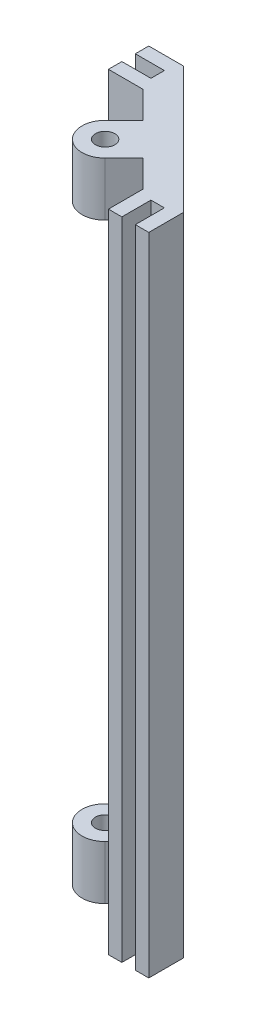
ISO-10303-21;
HEADER;
FILE_DESCRIPTION(('STEP AP214'),'2;1');
FILE_NAME('part.step','',(''),(''),'','','');
FILE_SCHEMA(('AUTOMOTIVE_DESIGN { 1 0 10303 214 1 1 1 1 }'));
ENDSEC;
DATA;
#1=APPLICATION_CONTEXT('core data for automotive mechanical design processes');
#2=APPLICATION_PROTOCOL_DEFINITION('international standard','automotive_design',2000,#1);
#3=PRODUCT_CONTEXT('',#1,'mechanical');
#4=PRODUCT('Part','Part','',(#3));
#5=PRODUCT_RELATED_PRODUCT_CATEGORY('part','',(#4));
#6=PRODUCT_DEFINITION_FORMATION('','',#4);
#7=PRODUCT_DEFINITION_CONTEXT('part definition',#1,'design');
#8=PRODUCT_DEFINITION('design','',#6,#7);
#9=PRODUCT_DEFINITION_SHAPE('','',#8);
#10=(LENGTH_UNIT() NAMED_UNIT(*) SI_UNIT(.MILLI.,.METRE.));
#11=(NAMED_UNIT(*) PLANE_ANGLE_UNIT() SI_UNIT($,.RADIAN.));
#12=(NAMED_UNIT(*) SI_UNIT($,.STERADIAN.) SOLID_ANGLE_UNIT());
#13=UNCERTAINTY_MEASURE_WITH_UNIT(LENGTH_MEASURE(1.E-05),#10,'distance_accuracy_value','');
#14=(GEOMETRIC_REPRESENTATION_CONTEXT(3) GLOBAL_UNCERTAINTY_ASSIGNED_CONTEXT((#13)) GLOBAL_UNIT_ASSIGNED_CONTEXT((#10,
#11,#12)) REPRESENTATION_CONTEXT('',''));
#15=CARTESIAN_POINT('',(0.,0.,0.));
#16=DIRECTION('',(0.,0.,1.));
#17=DIRECTION('',(1.,0.,0.));
#18=AXIS2_PLACEMENT_3D('',#15,#16,#17);
#19=CARTESIAN_POINT('',(22.2539461017924,152.4,-14.530925837673));
#20=DIRECTION('',(0.707106781186547,0.,-0.707106781186548));
#21=DIRECTION('',(-0.707106781186548,0.,-0.707106781186547));
#22=AXIS2_PLACEMENT_3D('',#19,#20,#21);
#23=PLANE('',#22);
#24=DIRECTION('',(0.,-1.,0.));
#25=VECTOR('',#24,1.);
#26=CARTESIAN_POINT('',(16.1473719394654,139.7,-20.6375));
#27=LINE('',#26,#25);
#28=CARTESIAN_POINT('',(16.1473719394654,139.7,-20.6375));
#29=VERTEX_POINT('',#28);
#30=CARTESIAN_POINT('',(16.1473719394654,12.7,-20.6375));
#31=VERTEX_POINT('',#30);
#32=EDGE_CURVE('E256',#29,#31,#27,.T.);
#33=ORIENTED_EDGE('',*,*,#32,.F.);
#34=DIRECTION('',(-0.707106781186554,0.,-0.707106781186541));
#35=VECTOR('',#34,1.);
#36=CARTESIAN_POINT('',(22.2539461017927,139.7,-14.5309258376728));
#37=LINE('',#36,#35);
#38=CARTESIAN_POINT('',(14.5309258376731,139.7,-22.2539461017922));
#39=VERTEX_POINT('',#38);
#40=EDGE_CURVE('E269',#29,#39,#37,.T.);
#41=ORIENTED_EDGE('',*,*,#40,.T.);
#42=DIRECTION('',(0.,-1.,0.));
#43=VECTOR('',#42,1.);
#44=CARTESIAN_POINT('',(14.530925837673,152.4,-22.2539461017924));
#45=LINE('',#44,#43);
#46=CARTESIAN_POINT('',(14.530925837673,152.4,-22.2539461017924));
#47=VERTEX_POINT('',#46);
#48=EDGE_CURVE('E474',#47,#39,#45,.T.);
#49=ORIENTED_EDGE('',*,*,#48,.F.);
#50=DIRECTION('',(0.707106781186547,0.,0.707106781186548));
#51=VECTOR('',#50,1.);
#52=CARTESIAN_POINT('',(8.20987193946542,152.4,-28.575));
#53=LINE('',#52,#51);
#54=CARTESIAN_POINT('',(8.20987193946542,152.4,-28.575));
#55=VERTEX_POINT('',#54);
#56=EDGE_CURVE('E341',#55,#47,#53,.T.);
#57=ORIENTED_EDGE('',*,*,#56,.F.);
#58=DIRECTION('',(0.,-1.,0.));
#59=VECTOR('',#58,1.);
#60=CARTESIAN_POINT('',(8.20987193946542,152.4,-28.575));
#61=LINE('',#60,#59);
#62=CARTESIAN_POINT('',(8.20987193946542,0.,-28.575));
#63=VERTEX_POINT('',#62);
#64=EDGE_CURVE('E478',#55,#63,#61,.T.);
#65=ORIENTED_EDGE('',*,*,#64,.T.);
#66=DIRECTION('',(0.707106781186547,0.,0.707106781186548));
#67=VECTOR('',#66,1.);
#68=CARTESIAN_POINT('',(8.20987193946542,0.,-28.575));
#69=LINE('',#68,#67);
#70=CARTESIAN_POINT('',(14.530925837673,0.,-22.2539461017924));
#71=VERTEX_POINT('',#70);
#72=EDGE_CURVE('E402',#63,#71,#69,.T.);
#73=ORIENTED_EDGE('',*,*,#72,.T.);
#74=CARTESIAN_POINT('',(14.5309258376731,12.7,-22.2539461017922));
#75=VERTEX_POINT('',#74);
#76=EDGE_CURVE('E473',#75,#71,#45,.T.);
#77=ORIENTED_EDGE('',*,*,#76,.F.);
#78=DIRECTION('',(0.707106781186554,0.,0.707106781186541));
#79=VECTOR('',#78,1.);
#80=CARTESIAN_POINT('',(22.2539461017927,12.7,-14.5309258376728));
#81=LINE('',#80,#79);
#82=EDGE_CURVE('E274',#75,#31,#81,.T.);
#83=ORIENTED_EDGE('',*,*,#82,.T.);
#84=EDGE_LOOP('',(#33,#41,#49,#57,#65,#73,#77,#83));
#85=FACE_BOUND('',#84,.T.);
#86=ADVANCED_FACE('F39',(#85),#23,.F.);
#87=DIRECTION('',(0.,1.,0.));
#88=VECTOR('',#87,1.);
#89=CARTESIAN_POINT('',(20.6375,139.7,-16.1473719394654));
#90=LINE('',#89,#88);
#91=CARTESIAN_POINT('',(20.6375,12.7,-16.1473719394654));
#92=VERTEX_POINT('',#91);
#93=CARTESIAN_POINT('',(20.6375,139.7,-16.1473719394654));
#94=VERTEX_POINT('',#93);
#95=EDGE_CURVE('E260',#92,#94,#90,.T.);
#96=ORIENTED_EDGE('',*,*,#95,.F.);
#97=CARTESIAN_POINT('',(22.2539461017924,12.7,-14.530925837673));
#98=VERTEX_POINT('',#97);
#99=EDGE_CURVE('E232',#92,#98,#81,.T.);
#100=ORIENTED_EDGE('',*,*,#99,.T.);
#101=DIRECTION('',(0.,-1.,0.));
#102=VECTOR('',#101,1.);
#103=CARTESIAN_POINT('',(22.2539461017924,152.4,-14.530925837673));
#104=LINE('',#103,#102);
#105=CARTESIAN_POINT('',(22.2539461017924,0.,-14.530925837673));
#106=VERTEX_POINT('',#105);
#107=EDGE_CURVE('E458',#98,#106,#104,.T.);
#108=ORIENTED_EDGE('',*,*,#107,.T.);
#109=DIRECTION('',(0.707106781186548,0.,0.707106781186547));
#110=VECTOR('',#109,1.);
#111=CARTESIAN_POINT('',(22.2539461017924,0.,-14.530925837673));
#112=LINE('',#111,#110);
#113=CARTESIAN_POINT('',(28.575,0.,-8.20987193946542));
#114=VERTEX_POINT('',#113);
#115=EDGE_CURVE('E418',#106,#114,#112,.T.);
#116=ORIENTED_EDGE('',*,*,#115,.T.);
#117=DIRECTION('',(0.,-1.,0.));
#118=VECTOR('',#117,1.);
#119=CARTESIAN_POINT('',(28.575,152.4,-8.20987193946542));
#120=LINE('',#119,#118);
#121=CARTESIAN_POINT('',(28.575,152.4,-8.20987193946542));
#122=VERTEX_POINT('',#121);
#123=EDGE_CURVE('E454',#122,#114,#120,.T.);
#124=ORIENTED_EDGE('',*,*,#123,.F.);
#125=DIRECTION('',(0.707106781186548,0.,0.707106781186547));
#126=VECTOR('',#125,1.);
#127=CARTESIAN_POINT('',(22.2539461017924,152.4,-14.530925837673));
#128=LINE('',#127,#126);
#129=CARTESIAN_POINT('',(22.2539461017924,152.4,-14.530925837673));
#130=VERTEX_POINT('',#129);
#131=EDGE_CURVE('E353',#130,#122,#128,.T.);
#132=ORIENTED_EDGE('',*,*,#131,.F.);
#133=CARTESIAN_POINT('',(22.2539461017927,139.7,-14.5309258376728));
#134=VERTEX_POINT('',#133);
#135=EDGE_CURVE('E459',#130,#134,#104,.T.);
#136=ORIENTED_EDGE('',*,*,#135,.T.);
#137=EDGE_CURVE('E270',#134,#94,#37,.T.);
#138=ORIENTED_EDGE('',*,*,#137,.T.);
#139=EDGE_LOOP('',(#96,#100,#108,#116,#124,#132,#136,#138));
#140=FACE_BOUND('',#139,.T.);
#141=ADVANCED_FACE('F530',(#140),#23,.F.);
#142=CARTESIAN_POINT('',(13.9023079091984,139.7,-6.17928764507842));
#143=DIRECTION('',(0.,-1.,0.));
#144=DIRECTION('',(0.,0.,-1.));
#145=AXIS2_PLACEMENT_3D('',#142,#143,#144);
#146=PLANE('',#145);
#147=CARTESIAN_POINT('',(13.9023079091981,139.7,-13.9023079091981));
#148=DIRECTION('',(0.,-1.,0.));
#149=DIRECTION('',(0.,0.,-1.));
#150=AXIS2_PLACEMENT_3D('',#147,#148,#149);
#151=CIRCLE('',#150,2.286);
#152=CARTESIAN_POINT('',(13.9023079091981,139.7,-16.1883079091981));
#153=VERTEX_POINT('',#152);
#154=EDGE_CURVE('E43',#153,#153,#151,.T.);
#155=ORIENTED_EDGE('',*,*,#154,.F.);
#156=EDGE_LOOP('',(#155));
#157=FACE_BOUND('',#156,.T.);
#158=ORIENTED_EDGE('',*,*,#40,.F.);
#159=DIRECTION('',(0.707106781186547,0.,-0.707106781186548));
#160=VECTOR('',#159,1.);
#161=CARTESIAN_POINT('',(15.2493463273585,139.7,-19.7394743878931));
#162=LINE('',#161,#160);
#163=CARTESIAN_POINT('',(15.2493463273585,139.7,-19.7394743878931));
#164=VERTEX_POINT('',#163);
#165=EDGE_CURVE('E57',#164,#29,#162,.T.);
#166=ORIENTED_EDGE('',*,*,#165,.F.);
#167=DIRECTION('',(-0.707106781186548,0.,-0.707106781186547));
#168=VECTOR('',#167,1.);
#169=CARTESIAN_POINT('',(15.2493463273585,139.7,-19.7394743878931));
#170=LINE('',#169,#168);
#171=CARTESIAN_POINT('',(19.7394743878931,139.7,-15.2493463273585));
#172=VERTEX_POINT('',#171);
#173=EDGE_CURVE('E61',#172,#164,#170,.T.);
#174=ORIENTED_EDGE('',*,*,#173,.F.);
#175=DIRECTION('',(0.707106781186547,0.,-0.707106781186548));
#176=VECTOR('',#175,1.);
#177=CARTESIAN_POINT('',(19.7394743878931,139.7,-15.2493463273585));
#178=LINE('',#177,#176);
#179=EDGE_CURVE('E238',#172,#94,#178,.T.);
#180=ORIENTED_EDGE('',*,*,#179,.T.);
#181=ORIENTED_EDGE('',*,*,#137,.F.);
#182=DIRECTION('',(0.707106781186541,0.,-0.707106781186554));
#183=VECTOR('',#182,1.);
#184=CARTESIAN_POINT('',(13.9023079091984,139.7,-6.17928764507842));
#185=LINE('',#184,#183);
#186=CARTESIAN_POINT('',(17.7638180412581,139.7,-10.0407977771382));
#187=VERTEX_POINT('',#186);
#188=EDGE_CURVE('E289',#187,#134,#185,.T.);
#189=ORIENTED_EDGE('',*,*,#188,.F.);
#190=CARTESIAN_POINT('',(13.9023079091981,139.7,-13.9023079091981));
#191=DIRECTION('',(0.,-1.,0.));
#192=DIRECTION('',(0.,0.,-1.));
#193=AXIS2_PLACEMENT_3D('',#190,#191,#192);
#194=CIRCLE('',#193,5.461);
#195=CARTESIAN_POINT('',(10.0407977771386,139.7,-17.7638180412576));
#196=VERTEX_POINT('',#195);
#197=EDGE_CURVE('E297',#187,#196,#194,.T.);
#198=ORIENTED_EDGE('',*,*,#197,.T.);
#199=DIRECTION('',(0.707106781186541,0.,-0.707106781186554));
#200=VECTOR('',#199,1.);
#201=CARTESIAN_POINT('',(6.17928764507891,139.7,-13.9023079091978));
#202=LINE('',#201,#200);
#203=EDGE_CURVE('E285',#196,#39,#202,.T.);
#204=ORIENTED_EDGE('',*,*,#203,.T.);
#205=EDGE_LOOP('',(#158,#166,#174,#180,#181,#189,#198,#204));
#206=FACE_BOUND('',#205,.T.);
#207=ADVANCED_FACE('F520',(#157,#206),#146,.T.);
#208=CARTESIAN_POINT('',(13.9023079091984,12.7,-6.17928764507842));
#209=DIRECTION('',(0.,1.,0.));
#210=DIRECTION('',(-1.,0.,0.));
#211=AXIS2_PLACEMENT_3D('',#208,#209,#210);
#212=PLANE('',#211);
#213=CARTESIAN_POINT('',(13.9023079091981,12.7,-13.9023079091981));
#214=DIRECTION('',(0.,1.,0.));
#215=DIRECTION('',(-1.,0.,0.));
#216=AXIS2_PLACEMENT_3D('',#213,#214,#215);
#217=CIRCLE('',#216,2.286);
#218=CARTESIAN_POINT('',(11.6163079091981,12.7,-13.9023079091981));
#219=VERTEX_POINT('',#218);
#220=EDGE_CURVE('E293',#219,#219,#217,.T.);
#221=ORIENTED_EDGE('',*,*,#220,.F.);
#222=EDGE_LOOP('',(#221));
#223=FACE_BOUND('',#222,.T.);
#224=DIRECTION('',(0.707106781186548,0.,0.707106781186547));
#225=VECTOR('',#224,1.);
#226=CARTESIAN_POINT('',(15.2493463273585,12.7,-19.7394743878931));
#227=LINE('',#226,#225);
#228=CARTESIAN_POINT('',(15.2493463273585,12.7,-19.7394743878931));
#229=VERTEX_POINT('',#228);
#230=CARTESIAN_POINT('',(19.7394743878931,12.7,-15.2493463273585));
#231=VERTEX_POINT('',#230);
#232=EDGE_CURVE('E229',#229,#231,#227,.T.);
#233=ORIENTED_EDGE('',*,*,#232,.F.);
#234=DIRECTION('',(0.707106781186547,0.,-0.707106781186548));
#235=VECTOR('',#234,1.);
#236=CARTESIAN_POINT('',(15.2493463273585,12.7,-19.7394743878931));
#237=LINE('',#236,#235);
#238=EDGE_CURVE('E237',#229,#31,#237,.T.);
#239=ORIENTED_EDGE('',*,*,#238,.T.);
#240=ORIENTED_EDGE('',*,*,#82,.F.);
#241=DIRECTION('',(0.707106781186541,0.,-0.707106781186554));
#242=VECTOR('',#241,1.);
#243=CARTESIAN_POINT('',(6.17928764507891,12.7,-13.9023079091978));
#244=LINE('',#243,#242);
#245=CARTESIAN_POINT('',(10.0407977771386,12.7,-17.7638180412576));
#246=VERTEX_POINT('',#245);
#247=EDGE_CURVE('E281',#246,#75,#244,.T.);
#248=ORIENTED_EDGE('',*,*,#247,.F.);
#249=CARTESIAN_POINT('',(13.9023079091981,12.7,-13.9023079091981));
#250=DIRECTION('',(0.,1.,0.));
#251=DIRECTION('',(-1.,0.,0.));
#252=AXIS2_PLACEMENT_3D('',#249,#250,#251);
#253=CIRCLE('',#252,5.461);
#254=CARTESIAN_POINT('',(17.7638180412581,12.7,-10.0407977771382));
#255=VERTEX_POINT('',#254);
#256=EDGE_CURVE('E294',#246,#255,#253,.T.);
#257=ORIENTED_EDGE('',*,*,#256,.T.);
#258=DIRECTION('',(0.707106781186541,0.,-0.707106781186554));
#259=VECTOR('',#258,1.);
#260=CARTESIAN_POINT('',(13.9023079091984,12.7,-6.17928764507842));
#261=LINE('',#260,#259);
#262=EDGE_CURVE('E278',#255,#98,#261,.T.);
#263=ORIENTED_EDGE('',*,*,#262,.T.);
#264=ORIENTED_EDGE('',*,*,#99,.F.);
#265=DIRECTION('',(0.707106781186547,0.,-0.707106781186548));
#266=VECTOR('',#265,1.);
#267=CARTESIAN_POINT('',(19.7394743878931,12.7,-15.2493463273585));
#268=LINE('',#267,#266);
#269=EDGE_CURVE('E226',#231,#92,#268,.T.);
#270=ORIENTED_EDGE('',*,*,#269,.F.);
#271=EDGE_LOOP('',(#233,#239,#240,#248,#257,#263,#264,#270));
#272=FACE_BOUND('',#271,.T.);
#273=ADVANCED_FACE('F228',(#223,#272),#212,.T.);
#274=CARTESIAN_POINT('',(14.530925837673,152.4,-22.2539461017924));
#275=DIRECTION('',(0.707106781186548,0.,0.707106781186548));
#276=DIRECTION('',(0.707106781186548,0.,-0.707106781186548));
#277=AXIS2_PLACEMENT_3D('',#274,#275,#276);
#278=PLANE('',#277);
#279=ORIENTED_EDGE('',*,*,#203,.F.);
#280=DIRECTION('',(0.,-1.,0.));
#281=VECTOR('',#280,1.);
#282=CARTESIAN_POINT('',(10.0407977771384,152.4,-17.7638180412579));
#283=LINE('',#282,#281);
#284=CARTESIAN_POINT('',(10.0407977771384,152.4,-17.7638180412579));
#285=VERTEX_POINT('',#284);
#286=EDGE_CURVE('E469',#285,#196,#283,.T.);
#287=ORIENTED_EDGE('',*,*,#286,.F.);
#288=DIRECTION('',(-0.707106781186548,0.,0.707106781186548));
#289=VECTOR('',#288,1.);
#290=CARTESIAN_POINT('',(14.530925837673,152.4,-22.2539461017924));
#291=LINE('',#290,#289);
#292=EDGE_CURVE('E344',#47,#285,#291,.T.);
#293=ORIENTED_EDGE('',*,*,#292,.F.);
#294=ORIENTED_EDGE('',*,*,#48,.T.);
#295=EDGE_LOOP('',(#279,#287,#293,#294));
#296=FACE_BOUND('',#295,.T.);
#297=ADVANCED_FACE('F519',(#296),#278,.F.);
#298=ORIENTED_EDGE('',*,*,#247,.T.);
#299=ORIENTED_EDGE('',*,*,#76,.T.);
#300=DIRECTION('',(-0.707106781186548,0.,0.707106781186548));
#301=VECTOR('',#300,1.);
#302=CARTESIAN_POINT('',(14.530925837673,0.,-22.2539461017924));
#303=LINE('',#302,#301);
#304=CARTESIAN_POINT('',(10.0407977771384,0.,-17.7638180412579));
#305=VERTEX_POINT('',#304);
#306=EDGE_CURVE('E406',#71,#305,#303,.T.);
#307=ORIENTED_EDGE('',*,*,#306,.T.);
#308=EDGE_CURVE('E468',#246,#305,#283,.T.);
#309=ORIENTED_EDGE('',*,*,#308,.F.);
#310=EDGE_LOOP('',(#298,#299,#307,#309));
#311=FACE_BOUND('',#310,.T.);
#312=ADVANCED_FACE('F527',(#311),#278,.F.);
#313=CARTESIAN_POINT('',(13.9023079091981,152.4,-13.9023079091981));
#314=DIRECTION('',(0.,-1.,0.));
#315=DIRECTION('',(0.,0.,-1.));
#316=AXIS2_PLACEMENT_3D('',#313,#314,#315);
#317=CYLINDRICAL_SURFACE('',#316,5.461);
#318=ORIENTED_EDGE('',*,*,#197,.F.);
#319=DIRECTION('',(0.,-1.,0.));
#320=VECTOR('',#319,1.);
#321=CARTESIAN_POINT('',(17.7638180412579,152.4,-10.0407977771384));
#322=LINE('',#321,#320);
#323=CARTESIAN_POINT('',(17.7638180412579,152.4,-10.0407977771384));
#324=VERTEX_POINT('',#323);
#325=EDGE_CURVE('E464',#324,#187,#322,.T.);
#326=ORIENTED_EDGE('',*,*,#325,.F.);
#327=CARTESIAN_POINT('',(13.9023079091981,152.4,-13.9023079091981));
#328=DIRECTION('',(0.,1.,0.));
#329=DIRECTION('',(0.,0.,1.));
#330=AXIS2_PLACEMENT_3D('',#327,#328,#329);
#331=CIRCLE('',#330,5.461);
#332=EDGE_CURVE('E347',#285,#324,#331,.T.);
#333=ORIENTED_EDGE('',*,*,#332,.F.);
#334=ORIENTED_EDGE('',*,*,#286,.T.);
#335=EDGE_LOOP('',(#318,#326,#333,#334));
#336=FACE_BOUND('',#335,.T.);
#337=ADVANCED_FACE('F552',(#336),#317,.T.);
#338=ORIENTED_EDGE('',*,*,#256,.F.);
#339=ORIENTED_EDGE('',*,*,#308,.T.);
#340=CARTESIAN_POINT('',(13.9023079091981,0.,-13.9023079091981));
#341=DIRECTION('',(0.,1.,0.));
#342=DIRECTION('',(0.,0.,1.));
#343=AXIS2_PLACEMENT_3D('',#340,#341,#342);
#344=CIRCLE('',#343,5.461);
#345=CARTESIAN_POINT('',(17.7638180412579,0.,-10.0407977771384));
#346=VERTEX_POINT('',#345);
#347=EDGE_CURVE('E410',#305,#346,#344,.T.);
#348=ORIENTED_EDGE('',*,*,#347,.T.);
#349=EDGE_CURVE('E463',#255,#346,#322,.T.);
#350=ORIENTED_EDGE('',*,*,#349,.F.);
#351=EDGE_LOOP('',(#338,#339,#348,#350));
#352=FACE_BOUND('',#351,.T.);
#353=ADVANCED_FACE('F550',(#352),#317,.T.);
#354=CARTESIAN_POINT('',(17.7638180412579,152.4,-10.0407977771384));
#355=DIRECTION('',(-0.707106781186548,0.,-0.707106781186547));
#356=DIRECTION('',(-0.707106781186547,0.,0.707106781186548));
#357=AXIS2_PLACEMENT_3D('',#354,#355,#356);
#358=PLANE('',#357);
#359=ORIENTED_EDGE('',*,*,#188,.T.);
#360=ORIENTED_EDGE('',*,*,#135,.F.);
#361=DIRECTION('',(0.707106781186547,0.,-0.707106781186548));
#362=VECTOR('',#361,1.);
#363=CARTESIAN_POINT('',(17.7638180412579,152.4,-10.0407977771384));
#364=LINE('',#363,#362);
#365=EDGE_CURVE('E350',#324,#130,#364,.T.);
#366=ORIENTED_EDGE('',*,*,#365,.F.);
#367=ORIENTED_EDGE('',*,*,#325,.T.);
#368=EDGE_LOOP('',(#359,#360,#366,#367));
#369=FACE_BOUND('',#368,.T.);
#370=ADVANCED_FACE('F546',(#369),#358,.F.);
#371=ORIENTED_EDGE('',*,*,#262,.F.);
#372=ORIENTED_EDGE('',*,*,#349,.T.);
#373=DIRECTION('',(0.707106781186547,0.,-0.707106781186548));
#374=VECTOR('',#373,1.);
#375=CARTESIAN_POINT('',(17.7638180412579,0.,-10.0407977771384));
#376=LINE('',#375,#374);
#377=EDGE_CURVE('E414',#346,#106,#376,.T.);
#378=ORIENTED_EDGE('',*,*,#377,.T.);
#379=ORIENTED_EDGE('',*,*,#107,.F.);
#380=EDGE_LOOP('',(#371,#372,#378,#379));
#381=FACE_BOUND('',#380,.T.);
#382=ADVANCED_FACE('F549',(#381),#358,.F.);
#383=CARTESIAN_POINT('',(13.9023079091981,152.4,-13.9023079091981));
#384=DIRECTION('',(0.,-1.,0.));
#385=DIRECTION('',(0.,0.,-1.));
#386=AXIS2_PLACEMENT_3D('',#383,#384,#385);
#387=CYLINDRICAL_SURFACE('',#386,2.286);
#388=CARTESIAN_POINT('',(13.9023079091981,152.4,-13.9023079091981));
#389=DIRECTION('',(0.,1.,0.));
#390=DIRECTION('',(0.,0.,1.));
#391=AXIS2_PLACEMENT_3D('',#388,#389,#390);
#392=CIRCLE('',#391,2.286);
#393=CARTESIAN_POINT('',(13.9023079091981,152.4,-11.6163079091981));
#394=VERTEX_POINT('',#393);
#395=EDGE_CURVE('E301',#394,#394,#392,.T.);
#396=ORIENTED_EDGE('',*,*,#395,.T.);
#397=EDGE_LOOP('',(#396));
#398=FACE_BOUND('',#397,.T.);
#399=ORIENTED_EDGE('',*,*,#154,.T.);
#400=EDGE_LOOP('',(#399));
#401=FACE_BOUND('',#400,.T.);
#402=ADVANCED_FACE('F772',(#398,#401),#387,.F.);
#403=CARTESIAN_POINT('',(13.9023079091981,0.,-13.9023079091981));
#404=DIRECTION('',(0.,1.,0.));
#405=DIRECTION('',(0.,0.,1.));
#406=AXIS2_PLACEMENT_3D('',#403,#404,#405);
#407=CIRCLE('',#406,2.286);
#408=CARTESIAN_POINT('',(13.9023079091981,0.,-11.6163079091981));
#409=VERTEX_POINT('',#408);
#410=EDGE_CURVE('E300',#409,#409,#407,.T.);
#411=ORIENTED_EDGE('',*,*,#410,.F.);
#412=EDGE_LOOP('',(#411));
#413=FACE_BOUND('',#412,.T.);
#414=ORIENTED_EDGE('',*,*,#220,.T.);
#415=EDGE_LOOP('',(#414));
#416=FACE_BOUND('',#415,.T.);
#417=ADVANCED_FACE('F516',(#413,#416),#387,.F.);
#418=CARTESIAN_POINT('',(13.9023079091981,152.4,-13.9023079091981));
#419=DIRECTION('',(0.,1.,0.));
#420=DIRECTION('',(0.,0.,1.));
#421=AXIS2_PLACEMENT_3D('',#418,#419,#420);
#422=PLANE('',#421);
#423=DIRECTION('',(1.,0.,0.));
#424=VECTOR('',#423,1.);
#425=CARTESIAN_POINT('',(34.925,152.4,0.));
#426=LINE('',#425,#424);
#427=CARTESIAN_POINT('',(34.925,152.4,0.));
#428=VERTEX_POINT('',#427);
#429=CARTESIAN_POINT('',(38.1,152.4,0.));
#430=VERTEX_POINT('',#429);
#431=EDGE_CURVE('E309',#428,#430,#426,.T.);
#432=ORIENTED_EDGE('',*,*,#431,.T.);
#433=DIRECTION('',(0.,0.,-1.));
#434=VECTOR('',#433,1.);
#435=CARTESIAN_POINT('',(38.1,152.4,0.));
#436=LINE('',#435,#434);
#437=CARTESIAN_POINT('',(38.1,152.4,-8.20987193946542));
#438=VERTEX_POINT('',#437);
#439=EDGE_CURVE('E313',#430,#438,#436,.T.);
#440=ORIENTED_EDGE('',*,*,#439,.T.);
#441=DIRECTION('',(-0.707106781186547,0.,-0.707106781186547));
#442=VECTOR('',#441,1.);
#443=CARTESIAN_POINT('',(38.1,152.4,-8.20987193946542));
#444=LINE('',#443,#442);
#445=CARTESIAN_POINT('',(8.20987193946542,152.4,-38.1));
#446=VERTEX_POINT('',#445);
#447=EDGE_CURVE('E317',#438,#446,#444,.T.);
#448=ORIENTED_EDGE('',*,*,#447,.T.);
#449=DIRECTION('',(-1.,0.,0.));
#450=VECTOR('',#449,1.);
#451=CARTESIAN_POINT('',(8.20987193946542,152.4,-38.1));
#452=LINE('',#451,#450);
#453=CARTESIAN_POINT('',(0.,152.4,-38.1));
#454=VERTEX_POINT('',#453);
#455=EDGE_CURVE('E320',#446,#454,#452,.T.);
#456=ORIENTED_EDGE('',*,*,#455,.T.);
#457=DIRECTION('',(0.,0.,1.));
#458=VECTOR('',#457,1.);
#459=CARTESIAN_POINT('',(0.,152.4,-38.1));
#460=LINE('',#459,#458);
#461=CARTESIAN_POINT('',(0.,152.4,-34.925));
#462=VERTEX_POINT('',#461);
#463=EDGE_CURVE('E323',#454,#462,#460,.T.);
#464=ORIENTED_EDGE('',*,*,#463,.T.);
#465=DIRECTION('',(1.,0.,0.));
#466=VECTOR('',#465,1.);
#467=CARTESIAN_POINT('',(0.,152.4,-34.925));
#468=LINE('',#467,#466);
#469=CARTESIAN_POINT('',(6.858,152.4,-34.925));
#470=VERTEX_POINT('',#469);
#471=EDGE_CURVE('E326',#462,#470,#468,.T.);
#472=ORIENTED_EDGE('',*,*,#471,.T.);
#473=DIRECTION('',(0.,0.,1.));
#474=VECTOR('',#473,1.);
#475=CARTESIAN_POINT('',(6.858,152.4,-31.75));
#476=LINE('',#475,#474);
#477=CARTESIAN_POINT('',(6.858,152.4,-31.75));
#478=VERTEX_POINT('',#477);
#479=EDGE_CURVE('E329',#470,#478,#476,.T.);
#480=ORIENTED_EDGE('',*,*,#479,.T.);
#481=DIRECTION('',(-1.,0.,0.));
#482=VECTOR('',#481,1.);
#483=CARTESIAN_POINT('',(0.,152.4,-31.75));
#484=LINE('',#483,#482);
#485=CARTESIAN_POINT('',(0.,152.4,-31.75));
#486=VERTEX_POINT('',#485);
#487=EDGE_CURVE('E332',#478,#486,#484,.T.);
#488=ORIENTED_EDGE('',*,*,#487,.T.);
#489=DIRECTION('',(0.,0.,1.));
#490=VECTOR('',#489,1.);
#491=CARTESIAN_POINT('',(0.,152.4,-31.75));
#492=LINE('',#491,#490);
#493=CARTESIAN_POINT('',(0.,152.4,-28.575));
#494=VERTEX_POINT('',#493);
#495=EDGE_CURVE('E335',#486,#494,#492,.T.);
#496=ORIENTED_EDGE('',*,*,#495,.T.);
#497=DIRECTION('',(1.,0.,0.));
#498=VECTOR('',#497,1.);
#499=CARTESIAN_POINT('',(0.,152.4,-28.575));
#500=LINE('',#499,#498);
#501=EDGE_CURVE('E338',#494,#55,#500,.T.);
#502=ORIENTED_EDGE('',*,*,#501,.T.);
#503=ORIENTED_EDGE('',*,*,#56,.T.);
#504=ORIENTED_EDGE('',*,*,#292,.T.);
#505=ORIENTED_EDGE('',*,*,#332,.T.);
#506=ORIENTED_EDGE('',*,*,#365,.T.);
#507=ORIENTED_EDGE('',*,*,#131,.T.);
#508=DIRECTION('',(0.,0.,1.));
#509=VECTOR('',#508,1.);
#510=CARTESIAN_POINT('',(28.575,152.4,-8.20987193946542));
#511=LINE('',#510,#509);
#512=CARTESIAN_POINT('',(28.575,152.4,0.));
#513=VERTEX_POINT('',#512);
#514=EDGE_CURVE('E356',#122,#513,#511,.T.);
#515=ORIENTED_EDGE('',*,*,#514,.T.);
#516=DIRECTION('',(1.,0.,0.));
#517=VECTOR('',#516,1.);
#518=CARTESIAN_POINT('',(28.575,152.4,0.));
#519=LINE('',#518,#517);
#520=CARTESIAN_POINT('',(31.75,152.4,0.));
#521=VERTEX_POINT('',#520);
#522=EDGE_CURVE('E359',#513,#521,#519,.T.);
#523=ORIENTED_EDGE('',*,*,#522,.T.);
#524=DIRECTION('',(0.,0.,-1.));
#525=VECTOR('',#524,1.);
#526=CARTESIAN_POINT('',(31.75,152.4,0.));
#527=LINE('',#526,#525);
#528=CARTESIAN_POINT('',(31.75,152.4,-6.858));
#529=VERTEX_POINT('',#528);
#530=EDGE_CURVE('E362',#521,#529,#527,.T.);
#531=ORIENTED_EDGE('',*,*,#530,.T.);
#532=DIRECTION('',(1.,0.,0.));
#533=VECTOR('',#532,1.);
#534=CARTESIAN_POINT('',(31.75,152.4,-6.858));
#535=LINE('',#534,#533);
#536=CARTESIAN_POINT('',(34.925,152.4,-6.858));
#537=VERTEX_POINT('',#536);
#538=EDGE_CURVE('E365',#529,#537,#535,.T.);
#539=ORIENTED_EDGE('',*,*,#538,.T.);
#540=DIRECTION('',(0.,0.,1.));
#541=VECTOR('',#540,1.);
#542=CARTESIAN_POINT('',(34.925,152.4,0.));
#543=LINE('',#542,#541);
#544=EDGE_CURVE('E368',#537,#428,#543,.T.);
#545=ORIENTED_EDGE('',*,*,#544,.T.);
#546=EDGE_LOOP('',(#432,#440,#448,#456,#464,#472,#480,#488,#496,#502,#503,#504,#505,#506,#507,
#515,#523,#531,#539,#545));
#547=FACE_BOUND('',#546,.T.);
#548=ORIENTED_EDGE('',*,*,#395,.F.);
#549=EDGE_LOOP('',(#548));
#550=FACE_BOUND('',#549,.T.);
#551=ADVANCED_FACE('F612',(#547,#550),#422,.T.);
#552=CARTESIAN_POINT('',(13.9023079091981,0.,-13.9023079091981));
#553=DIRECTION('',(0.,1.,0.));
#554=DIRECTION('',(0.,0.,1.));
#555=AXIS2_PLACEMENT_3D('',#552,#553,#554);
#556=PLANE('',#555);
#557=DIRECTION('',(1.,0.,0.));
#558=VECTOR('',#557,1.);
#559=CARTESIAN_POINT('',(34.925,0.,0.));
#560=LINE('',#559,#558);
#561=CARTESIAN_POINT('',(34.925,0.,0.));
#562=VERTEX_POINT('',#561);
#563=CARTESIAN_POINT('',(38.1,0.,0.));
#564=VERTEX_POINT('',#563);
#565=EDGE_CURVE('E305',#562,#564,#560,.T.);
#566=ORIENTED_EDGE('',*,*,#565,.F.);
#567=DIRECTION('',(0.,0.,1.));
#568=VECTOR('',#567,1.);
#569=CARTESIAN_POINT('',(34.925,0.,0.));
#570=LINE('',#569,#568);
#571=CARTESIAN_POINT('',(34.925,0.,-6.858));
#572=VERTEX_POINT('',#571);
#573=EDGE_CURVE('E314',#572,#562,#570,.T.);
#574=ORIENTED_EDGE('',*,*,#573,.F.);
#575=DIRECTION('',(1.,0.,0.));
#576=VECTOR('',#575,1.);
#577=CARTESIAN_POINT('',(31.75,0.,-6.858));
#578=LINE('',#577,#576);
#579=CARTESIAN_POINT('',(31.75,0.,-6.858));
#580=VERTEX_POINT('',#579);
#581=EDGE_CURVE('E430',#580,#572,#578,.T.);
#582=ORIENTED_EDGE('',*,*,#581,.F.);
#583=DIRECTION('',(0.,0.,-1.));
#584=VECTOR('',#583,1.);
#585=CARTESIAN_POINT('',(31.75,0.,0.));
#586=LINE('',#585,#584);
#587=CARTESIAN_POINT('',(31.75,0.,0.));
#588=VERTEX_POINT('',#587);
#589=EDGE_CURVE('E427',#588,#580,#586,.T.);
#590=ORIENTED_EDGE('',*,*,#589,.F.);
#591=DIRECTION('',(1.,0.,0.));
#592=VECTOR('',#591,1.);
#593=CARTESIAN_POINT('',(28.575,0.,0.));
#594=LINE('',#593,#592);
#595=CARTESIAN_POINT('',(28.575,0.,0.));
#596=VERTEX_POINT('',#595);
#597=EDGE_CURVE('E424',#596,#588,#594,.T.);
#598=ORIENTED_EDGE('',*,*,#597,.F.);
#599=DIRECTION('',(0.,0.,1.));
#600=VECTOR('',#599,1.);
#601=CARTESIAN_POINT('',(28.575,0.,-8.20987193946542));
#602=LINE('',#601,#600);
#603=EDGE_CURVE('E421',#114,#596,#602,.T.);
#604=ORIENTED_EDGE('',*,*,#603,.F.);
#605=ORIENTED_EDGE('',*,*,#115,.F.);
#606=ORIENTED_EDGE('',*,*,#377,.F.);
#607=ORIENTED_EDGE('',*,*,#347,.F.);
#608=ORIENTED_EDGE('',*,*,#306,.F.);
#609=ORIENTED_EDGE('',*,*,#72,.F.);
#610=DIRECTION('',(1.,0.,0.));
#611=VECTOR('',#610,1.);
#612=CARTESIAN_POINT('',(0.,0.,-28.575));
#613=LINE('',#612,#611);
#614=CARTESIAN_POINT('',(0.,0.,-28.575));
#615=VERTEX_POINT('',#614);
#616=EDGE_CURVE('E399',#615,#63,#613,.T.);
#617=ORIENTED_EDGE('',*,*,#616,.F.);
#618=DIRECTION('',(0.,0.,1.));
#619=VECTOR('',#618,1.);
#620=CARTESIAN_POINT('',(0.,0.,-31.75));
#621=LINE('',#620,#619);
#622=CARTESIAN_POINT('',(0.,0.,-31.75));
#623=VERTEX_POINT('',#622);
#624=EDGE_CURVE('E396',#623,#615,#621,.T.);
#625=ORIENTED_EDGE('',*,*,#624,.F.);
#626=DIRECTION('',(-1.,0.,0.));
#627=VECTOR('',#626,1.);
#628=CARTESIAN_POINT('',(0.,0.,-31.75));
#629=LINE('',#628,#627);
#630=CARTESIAN_POINT('',(6.858,0.,-31.75));
#631=VERTEX_POINT('',#630);
#632=EDGE_CURVE('E393',#631,#623,#629,.T.);
#633=ORIENTED_EDGE('',*,*,#632,.F.);
#634=DIRECTION('',(0.,0.,1.));
#635=VECTOR('',#634,1.);
#636=CARTESIAN_POINT('',(6.858,0.,-31.75));
#637=LINE('',#636,#635);
#638=CARTESIAN_POINT('',(6.858,0.,-34.925));
#639=VERTEX_POINT('',#638);
#640=EDGE_CURVE('E390',#639,#631,#637,.T.);
#641=ORIENTED_EDGE('',*,*,#640,.F.);
#642=DIRECTION('',(1.,0.,0.));
#643=VECTOR('',#642,1.);
#644=CARTESIAN_POINT('',(0.,0.,-34.925));
#645=LINE('',#644,#643);
#646=CARTESIAN_POINT('',(0.,0.,-34.925));
#647=VERTEX_POINT('',#646);
#648=EDGE_CURVE('E387',#647,#639,#645,.T.);
#649=ORIENTED_EDGE('',*,*,#648,.F.);
#650=DIRECTION('',(0.,0.,1.));
#651=VECTOR('',#650,1.);
#652=CARTESIAN_POINT('',(0.,0.,-38.1));
#653=LINE('',#652,#651);
#654=CARTESIAN_POINT('',(0.,0.,-38.1));
#655=VERTEX_POINT('',#654);
#656=EDGE_CURVE('E384',#655,#647,#653,.T.);
#657=ORIENTED_EDGE('',*,*,#656,.F.);
#658=DIRECTION('',(-1.,0.,0.));
#659=VECTOR('',#658,1.);
#660=CARTESIAN_POINT('',(8.20987193946542,0.,-38.1));
#661=LINE('',#660,#659);
#662=CARTESIAN_POINT('',(8.20987193946542,0.,-38.1));
#663=VERTEX_POINT('',#662);
#664=EDGE_CURVE('E381',#663,#655,#661,.T.);
#665=ORIENTED_EDGE('',*,*,#664,.F.);
#666=DIRECTION('',(-0.707106781186547,0.,-0.707106781186547));
#667=VECTOR('',#666,1.);
#668=CARTESIAN_POINT('',(38.1,0.,-8.20987193946542));
#669=LINE('',#668,#667);
#670=CARTESIAN_POINT('',(38.1,0.,-8.20987193946542));
#671=VERTEX_POINT('',#670);
#672=EDGE_CURVE('E378',#671,#663,#669,.T.);
#673=ORIENTED_EDGE('',*,*,#672,.F.);
#674=DIRECTION('',(0.,0.,-1.));
#675=VECTOR('',#674,1.);
#676=CARTESIAN_POINT('',(38.1,0.,0.));
#677=LINE('',#676,#675);
#678=EDGE_CURVE('E375',#564,#671,#677,.T.);
#679=ORIENTED_EDGE('',*,*,#678,.F.);
#680=EDGE_LOOP('',(#566,#574,#582,#590,#598,#604,#605,#606,#607,#608,#609,#617,#625,#633,#641,
#649,#657,#665,#673,#679));
#681=FACE_BOUND('',#680,.T.);
#682=ORIENTED_EDGE('',*,*,#410,.T.);
#683=EDGE_LOOP('',(#682));
#684=FACE_BOUND('',#683,.T.);
#685=ADVANCED_FACE('F593',(#681,#684),#556,.F.);
#686=CARTESIAN_POINT('',(34.925,152.4,0.));
#687=DIRECTION('',(0.,0.,-1.));
#688=DIRECTION('',(-1.,0.,0.));
#689=AXIS2_PLACEMENT_3D('',#686,#687,#688);
#690=PLANE('',#689);
#691=ORIENTED_EDGE('',*,*,#565,.T.);
#692=DIRECTION('',(0.,-1.,0.));
#693=VECTOR('',#692,1.);
#694=CARTESIAN_POINT('',(38.1,152.4,0.));
#695=LINE('',#694,#693);
#696=EDGE_CURVE('E11',#430,#564,#695,.T.);
#697=ORIENTED_EDGE('',*,*,#696,.F.);
#698=ORIENTED_EDGE('',*,*,#431,.F.);
#699=DIRECTION('',(0.,-1.,0.));
#700=VECTOR('',#699,1.);
#701=CARTESIAN_POINT('',(34.925,152.4,0.));
#702=LINE('',#701,#700);
#703=EDGE_CURVE('E371',#428,#562,#702,.T.);
#704=ORIENTED_EDGE('',*,*,#703,.T.);
#705=EDGE_LOOP('',(#691,#697,#698,#704));
#706=FACE_BOUND('',#705,.T.);
#707=ADVANCED_FACE('F41',(#706),#690,.F.);
#708=CARTESIAN_POINT('',(38.1,152.4,0.));
#709=DIRECTION('',(-1.,0.,0.));
#710=DIRECTION('',(0.,0.,1.));
#711=AXIS2_PLACEMENT_3D('',#708,#709,#710);
#712=PLANE('',#711);
#713=ORIENTED_EDGE('',*,*,#678,.T.);
#714=DIRECTION('',(0.,-1.,0.));
#715=VECTOR('',#714,1.);
#716=CARTESIAN_POINT('',(38.1,152.4,-8.20987193946542));
#717=LINE('',#716,#715);
#718=EDGE_CURVE('E49',#438,#671,#717,.T.);
#719=ORIENTED_EDGE('',*,*,#718,.F.);
#720=ORIENTED_EDGE('',*,*,#439,.F.);
#721=ORIENTED_EDGE('',*,*,#696,.T.);
#722=EDGE_LOOP('',(#713,#719,#720,#721));
#723=FACE_BOUND('',#722,.T.);
#724=ADVANCED_FACE('F586',(#723),#712,.F.);
#725=CARTESIAN_POINT('',(38.1,152.4,-8.20987193946542));
#726=DIRECTION('',(-0.707106781186547,0.,0.707106781186547));
#727=DIRECTION('',(0.707106781186548,0.,0.707106781186548));
#728=AXIS2_PLACEMENT_3D('',#725,#726,#727);
#729=PLANE('',#728);
#730=ORIENTED_EDGE('',*,*,#672,.T.);
#731=DIRECTION('',(0.,-1.,0.));
#732=VECTOR('',#731,1.);
#733=CARTESIAN_POINT('',(8.20987193946542,152.4,-38.1));
#734=LINE('',#733,#732);
#735=EDGE_CURVE('E506',#446,#663,#734,.T.);
#736=ORIENTED_EDGE('',*,*,#735,.F.);
#737=ORIENTED_EDGE('',*,*,#447,.F.);
#738=ORIENTED_EDGE('',*,*,#718,.T.);
#739=EDGE_LOOP('',(#730,#736,#737,#738));
#740=FACE_BOUND('',#739,.T.);
#741=ADVANCED_FACE('F583',(#740),#729,.F.);
#742=CARTESIAN_POINT('',(8.20987193946542,152.4,-38.1));
#743=DIRECTION('',(0.,0.,1.));
#744=DIRECTION('',(1.,0.,0.));
#745=AXIS2_PLACEMENT_3D('',#742,#743,#744);
#746=PLANE('',#745);
#747=ORIENTED_EDGE('',*,*,#664,.T.);
#748=DIRECTION('',(0.,-1.,0.));
#749=VECTOR('',#748,1.);
#750=CARTESIAN_POINT('',(0.,152.4,-38.1));
#751=LINE('',#750,#749);
#752=EDGE_CURVE('E502',#454,#655,#751,.T.);
#753=ORIENTED_EDGE('',*,*,#752,.F.);
#754=ORIENTED_EDGE('',*,*,#455,.F.);
#755=ORIENTED_EDGE('',*,*,#735,.T.);
#756=EDGE_LOOP('',(#747,#753,#754,#755));
#757=FACE_BOUND('',#756,.T.);
#758=ADVANCED_FACE('F579',(#757),#746,.F.);
#759=CARTESIAN_POINT('',(0.,152.4,-38.1));
#760=DIRECTION('',(1.,0.,0.));
#761=DIRECTION('',(0.,0.,-1.));
#762=AXIS2_PLACEMENT_3D('',#759,#760,#761);
#763=PLANE('',#762);
#764=ORIENTED_EDGE('',*,*,#656,.T.);
#765=DIRECTION('',(0.,-1.,0.));
#766=VECTOR('',#765,1.);
#767=CARTESIAN_POINT('',(0.,152.4,-34.925));
#768=LINE('',#767,#766);
#769=EDGE_CURVE('E498',#462,#647,#768,.T.);
#770=ORIENTED_EDGE('',*,*,#769,.F.);
#771=ORIENTED_EDGE('',*,*,#463,.F.);
#772=ORIENTED_EDGE('',*,*,#752,.T.);
#773=EDGE_LOOP('',(#764,#770,#771,#772));
#774=FACE_BOUND('',#773,.T.);
#775=ADVANCED_FACE('F575',(#774),#763,.F.);
#776=CARTESIAN_POINT('',(0.,152.4,-34.925));
#777=DIRECTION('',(0.,0.,-1.));
#778=DIRECTION('',(-1.,0.,0.));
#779=AXIS2_PLACEMENT_3D('',#776,#777,#778);
#780=PLANE('',#779);
#781=ORIENTED_EDGE('',*,*,#648,.T.);
#782=DIRECTION('',(0.,-1.,0.));
#783=VECTOR('',#782,1.);
#784=CARTESIAN_POINT('',(6.858,152.4,-34.925));
#785=LINE('',#784,#783);
#786=EDGE_CURVE('E494',#470,#639,#785,.T.);
#787=ORIENTED_EDGE('',*,*,#786,.F.);
#788=ORIENTED_EDGE('',*,*,#471,.F.);
#789=ORIENTED_EDGE('',*,*,#769,.T.);
#790=EDGE_LOOP('',(#781,#787,#788,#789));
#791=FACE_BOUND('',#790,.T.);
#792=ADVANCED_FACE('F571',(#791),#780,.F.);
#793=CARTESIAN_POINT('',(6.858,152.4,-31.75));
#794=DIRECTION('',(1.,0.,0.));
#795=DIRECTION('',(0.,0.,-1.));
#796=AXIS2_PLACEMENT_3D('',#793,#794,#795);
#797=PLANE('',#796);
#798=ORIENTED_EDGE('',*,*,#640,.T.);
#799=DIRECTION('',(0.,-1.,0.));
#800=VECTOR('',#799,1.);
#801=CARTESIAN_POINT('',(6.858,152.4,-31.75));
#802=LINE('',#801,#800);
#803=EDGE_CURVE('E490',#478,#631,#802,.T.);
#804=ORIENTED_EDGE('',*,*,#803,.F.);
#805=ORIENTED_EDGE('',*,*,#479,.F.);
#806=ORIENTED_EDGE('',*,*,#786,.T.);
#807=EDGE_LOOP('',(#798,#804,#805,#806));
#808=FACE_BOUND('',#807,.T.);
#809=ADVANCED_FACE('F567',(#808),#797,.F.);
#810=CARTESIAN_POINT('',(0.,152.4,-31.75));
#811=DIRECTION('',(0.,0.,1.));
#812=DIRECTION('',(1.,0.,0.));
#813=AXIS2_PLACEMENT_3D('',#810,#811,#812);
#814=PLANE('',#813);
#815=ORIENTED_EDGE('',*,*,#632,.T.);
#816=DIRECTION('',(0.,-1.,0.));
#817=VECTOR('',#816,1.);
#818=CARTESIAN_POINT('',(0.,152.4,-31.75));
#819=LINE('',#818,#817);
#820=EDGE_CURVE('E486',#486,#623,#819,.T.);
#821=ORIENTED_EDGE('',*,*,#820,.F.);
#822=ORIENTED_EDGE('',*,*,#487,.F.);
#823=ORIENTED_EDGE('',*,*,#803,.T.);
#824=EDGE_LOOP('',(#815,#821,#822,#823));
#825=FACE_BOUND('',#824,.T.);
#826=ADVANCED_FACE('F563',(#825),#814,.F.);
#827=CARTESIAN_POINT('',(0.,152.4,-31.75));
#828=DIRECTION('',(1.,0.,0.));
#829=DIRECTION('',(0.,0.,-1.));
#830=AXIS2_PLACEMENT_3D('',#827,#828,#829);
#831=PLANE('',#830);
#832=ORIENTED_EDGE('',*,*,#624,.T.);
#833=DIRECTION('',(0.,-1.,0.));
#834=VECTOR('',#833,1.);
#835=CARTESIAN_POINT('',(0.,152.4,-28.575));
#836=LINE('',#835,#834);
#837=EDGE_CURVE('E482',#494,#615,#836,.T.);
#838=ORIENTED_EDGE('',*,*,#837,.F.);
#839=ORIENTED_EDGE('',*,*,#495,.F.);
#840=ORIENTED_EDGE('',*,*,#820,.T.);
#841=EDGE_LOOP('',(#832,#838,#839,#840));
#842=FACE_BOUND('',#841,.T.);
#843=ADVANCED_FACE('F559',(#842),#831,.F.);
#844=CARTESIAN_POINT('',(0.,152.4,-28.575));
#845=DIRECTION('',(0.,0.,-1.));
#846=DIRECTION('',(-1.,0.,0.));
#847=AXIS2_PLACEMENT_3D('',#844,#845,#846);
#848=PLANE('',#847);
#849=ORIENTED_EDGE('',*,*,#616,.T.);
#850=ORIENTED_EDGE('',*,*,#64,.F.);
#851=ORIENTED_EDGE('',*,*,#501,.F.);
#852=ORIENTED_EDGE('',*,*,#837,.T.);
#853=EDGE_LOOP('',(#849,#850,#851,#852));
#854=FACE_BOUND('',#853,.T.);
#855=ADVANCED_FACE('F556',(#854),#848,.F.);
#856=CARTESIAN_POINT('',(28.575,152.4,-8.20987193946542));
#857=DIRECTION('',(1.,0.,0.));
#858=DIRECTION('',(0.,0.,-1.));
#859=AXIS2_PLACEMENT_3D('',#856,#857,#858);
#860=PLANE('',#859);
#861=ORIENTED_EDGE('',*,*,#603,.T.);
#862=DIRECTION('',(0.,-1.,0.));
#863=VECTOR('',#862,1.);
#864=CARTESIAN_POINT('',(28.575,152.4,0.));
#865=LINE('',#864,#863);
#866=EDGE_CURVE('E450',#513,#596,#865,.T.);
#867=ORIENTED_EDGE('',*,*,#866,.F.);
#868=ORIENTED_EDGE('',*,*,#514,.F.);
#869=ORIENTED_EDGE('',*,*,#123,.T.);
#870=EDGE_LOOP('',(#861,#867,#868,#869));
#871=FACE_BOUND('',#870,.T.);
#872=ADVANCED_FACE('F544',(#871),#860,.F.);
#873=CARTESIAN_POINT('',(28.575,152.4,0.));
#874=DIRECTION('',(0.,0.,-1.));
#875=DIRECTION('',(-1.,0.,0.));
#876=AXIS2_PLACEMENT_3D('',#873,#874,#875);
#877=PLANE('',#876);
#878=ORIENTED_EDGE('',*,*,#597,.T.);
#879=DIRECTION('',(0.,-1.,0.));
#880=VECTOR('',#879,1.);
#881=CARTESIAN_POINT('',(31.75,152.4,0.));
#882=LINE('',#881,#880);
#883=EDGE_CURVE('E446',#521,#588,#882,.T.);
#884=ORIENTED_EDGE('',*,*,#883,.F.);
#885=ORIENTED_EDGE('',*,*,#522,.F.);
#886=ORIENTED_EDGE('',*,*,#866,.T.);
#887=EDGE_LOOP('',(#878,#884,#885,#886));
#888=FACE_BOUND('',#887,.T.);
#889=ADVANCED_FACE('F636',(#888),#877,.F.);
#890=CARTESIAN_POINT('',(31.75,152.4,0.));
#891=DIRECTION('',(-1.,0.,0.));
#892=DIRECTION('',(0.,0.,1.));
#893=AXIS2_PLACEMENT_3D('',#890,#891,#892);
#894=PLANE('',#893);
#895=ORIENTED_EDGE('',*,*,#589,.T.);
#896=DIRECTION('',(0.,-1.,0.));
#897=VECTOR('',#896,1.);
#898=CARTESIAN_POINT('',(31.75,152.4,-6.858));
#899=LINE('',#898,#897);
#900=EDGE_CURVE('E442',#529,#580,#899,.T.);
#901=ORIENTED_EDGE('',*,*,#900,.F.);
#902=ORIENTED_EDGE('',*,*,#530,.F.);
#903=ORIENTED_EDGE('',*,*,#883,.T.);
#904=EDGE_LOOP('',(#895,#901,#902,#903));
#905=FACE_BOUND('',#904,.T.);
#906=ADVANCED_FACE('F630',(#905),#894,.F.);
#907=CARTESIAN_POINT('',(31.75,152.4,-6.858));
#908=DIRECTION('',(0.,0.,-1.));
#909=DIRECTION('',(-1.,0.,0.));
#910=AXIS2_PLACEMENT_3D('',#907,#908,#909);
#911=PLANE('',#910);
#912=ORIENTED_EDGE('',*,*,#581,.T.);
#913=DIRECTION('',(0.,-1.,0.));
#914=VECTOR('',#913,1.);
#915=CARTESIAN_POINT('',(34.925,152.4,-6.858));
#916=LINE('',#915,#914);
#917=EDGE_CURVE('E438',#537,#572,#916,.T.);
#918=ORIENTED_EDGE('',*,*,#917,.F.);
#919=ORIENTED_EDGE('',*,*,#538,.F.);
#920=ORIENTED_EDGE('',*,*,#900,.T.);
#921=EDGE_LOOP('',(#912,#918,#919,#920));
#922=FACE_BOUND('',#921,.T.);
#923=ADVANCED_FACE('F626',(#922),#911,.F.);
#924=CARTESIAN_POINT('',(34.925,152.4,0.));
#925=DIRECTION('',(1.,0.,0.));
#926=DIRECTION('',(0.,0.,-1.));
#927=AXIS2_PLACEMENT_3D('',#924,#925,#926);
#928=PLANE('',#927);
#929=ORIENTED_EDGE('',*,*,#573,.T.);
#930=ORIENTED_EDGE('',*,*,#703,.F.);
#931=ORIENTED_EDGE('',*,*,#544,.F.);
#932=ORIENTED_EDGE('',*,*,#917,.T.);
#933=EDGE_LOOP('',(#929,#930,#931,#932));
#934=FACE_BOUND('',#933,.T.);
#935=ADVANCED_FACE('F622',(#934),#928,.F.);
#936=CARTESIAN_POINT('',(15.2493463273585,139.7,-19.7394743878931));
#937=DIRECTION('',(0.707106781186548,0.,0.707106781186547));
#938=DIRECTION('',(0.707106781186547,0.,-0.707106781186548));
#939=AXIS2_PLACEMENT_3D('',#936,#937,#938);
#940=PLANE('',#939);
#941=ORIENTED_EDGE('',*,*,#32,.T.);
#942=ORIENTED_EDGE('',*,*,#238,.F.);
#943=DIRECTION('',(0.,-1.,0.));
#944=VECTOR('',#943,1.);
#945=CARTESIAN_POINT('',(15.2493463273585,139.7,-19.7394743878931));
#946=LINE('',#945,#944);
#947=EDGE_CURVE('E245',#164,#229,#946,.T.);
#948=ORIENTED_EDGE('',*,*,#947,.F.);
#949=ORIENTED_EDGE('',*,*,#165,.T.);
#950=EDGE_LOOP('',(#941,#942,#948,#949));
#951=FACE_BOUND('',#950,.T.);
#952=ADVANCED_FACE('F682',(#951),#940,.F.);
#953=CARTESIAN_POINT('',(19.7394743878931,139.7,-15.2493463273585));
#954=DIRECTION('',(-0.707106781186548,0.,-0.707106781186547));
#955=DIRECTION('',(-0.707106781186547,0.,0.707106781186548));
#956=AXIS2_PLACEMENT_3D('',#953,#954,#955);
#957=PLANE('',#956);
#958=ORIENTED_EDGE('',*,*,#95,.T.);
#959=ORIENTED_EDGE('',*,*,#179,.F.);
#960=DIRECTION('',(0.,1.,0.));
#961=VECTOR('',#960,1.);
#962=CARTESIAN_POINT('',(19.7394743878931,139.7,-15.2493463273585));
#963=LINE('',#962,#961);
#964=EDGE_CURVE('E242',#231,#172,#963,.T.);
#965=ORIENTED_EDGE('',*,*,#964,.F.);
#966=ORIENTED_EDGE('',*,*,#269,.T.);
#967=EDGE_LOOP('',(#958,#959,#965,#966));
#968=FACE_BOUND('',#967,.T.);
#969=ADVANCED_FACE('F249',(#968),#957,.F.);
#970=CARTESIAN_POINT('',(17.4944103576258,0.,-17.4944103576258));
#971=DIRECTION('',(-0.707106781186547,0.,0.707106781186548));
#972=DIRECTION('',(0.707106781186548,0.,0.707106781186547));
#973=AXIS2_PLACEMENT_3D('',#970,#971,#972);
#974=PLANE('',#973);
#975=ORIENTED_EDGE('',*,*,#947,.T.);
#976=ORIENTED_EDGE('',*,*,#232,.T.);
#977=ORIENTED_EDGE('',*,*,#964,.T.);
#978=ORIENTED_EDGE('',*,*,#173,.T.);
#979=EDGE_LOOP('',(#975,#976,#977,#978));
#980=FACE_BOUND('',#979,.T.);
#981=ADVANCED_FACE('F241',(#980),#974,.T.);
#982=CLOSED_SHELL('',(#86,#141,#207,#273,#297,#312,#337,#353,#370,#382,#402,#417,#551,#685,#707,
#724,#741,#758,#775,#792,#809,#826,#843,#855,#872,#889,#906,#923,#935,#952,#969,#981));
#983=MANIFOLD_SOLID_BREP('B2',#982);
#984=ADVANCED_BREP_SHAPE_REPRESENTATION('',(#18,#983),#14);
#985=SHAPE_DEFINITION_REPRESENTATION(#9,#984);
ENDSEC;
END-ISO-10303-21;
